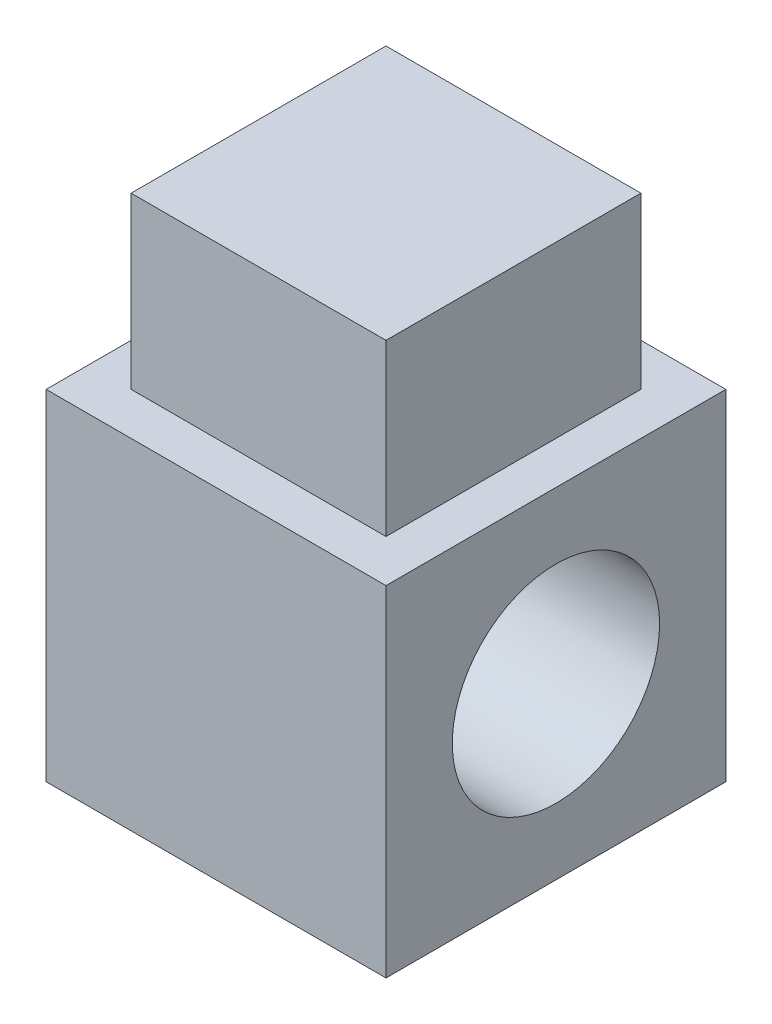
ISO-10303-21;
HEADER;
FILE_DESCRIPTION(('STEP AP214'),'2;1');
FILE_NAME('part.step','',(''),(''),'','','');
FILE_SCHEMA(('AUTOMOTIVE_DESIGN { 1 0 10303 214 1 1 1 1 }'));
ENDSEC;
DATA;
#1=APPLICATION_CONTEXT('core data for automotive mechanical design processes');
#2=APPLICATION_PROTOCOL_DEFINITION('international standard','automotive_design',2000,#1);
#3=PRODUCT_CONTEXT('',#1,'mechanical');
#4=PRODUCT('Part','Part','',(#3));
#5=PRODUCT_RELATED_PRODUCT_CATEGORY('part','',(#4));
#6=PRODUCT_DEFINITION_FORMATION('','',#4);
#7=PRODUCT_DEFINITION_CONTEXT('part definition',#1,'design');
#8=PRODUCT_DEFINITION('design','',#6,#7);
#9=PRODUCT_DEFINITION_SHAPE('','',#8);
#10=(LENGTH_UNIT() NAMED_UNIT(*) SI_UNIT(.MILLI.,.METRE.));
#11=(NAMED_UNIT(*) PLANE_ANGLE_UNIT() SI_UNIT($,.RADIAN.));
#12=(NAMED_UNIT(*) SI_UNIT($,.STERADIAN.) SOLID_ANGLE_UNIT());
#13=UNCERTAINTY_MEASURE_WITH_UNIT(LENGTH_MEASURE(1.E-05),#10,'distance_accuracy_value','');
#14=(GEOMETRIC_REPRESENTATION_CONTEXT(3) GLOBAL_UNCERTAINTY_ASSIGNED_CONTEXT((#13)) GLOBAL_UNIT_ASSIGNED_CONTEXT((#10,
#11,#12)) REPRESENTATION_CONTEXT('',''));
#15=CARTESIAN_POINT('',(0.,0.,0.));
#16=DIRECTION('',(0.,0.,1.));
#17=DIRECTION('',(1.,0.,0.));
#18=AXIS2_PLACEMENT_3D('',#15,#16,#17);
#19=CARTESIAN_POINT('',(10.,10.,10.));
#20=DIRECTION('',(0.,-1.,0.));
#21=DIRECTION('',(0.,0.,-1.));
#22=AXIS2_PLACEMENT_3D('',#19,#20,#21);
#23=PLANE('',#22);
#24=DIRECTION('',(0.,0.,1.));
#25=VECTOR('',#24,1.);
#26=CARTESIAN_POINT('',(-10.,10.,10.));
#27=LINE('',#26,#25);
#28=CARTESIAN_POINT('',(-10.,10.,-10.));
#29=VERTEX_POINT('',#28);
#30=CARTESIAN_POINT('',(-10.,10.,10.));
#31=VERTEX_POINT('',#30);
#32=EDGE_CURVE('E143',#29,#31,#27,.T.);
#33=ORIENTED_EDGE('',*,*,#32,.T.);
#34=DIRECTION('',(-1.,0.,0.));
#35=VECTOR('',#34,1.);
#36=CARTESIAN_POINT('',(10.,10.,10.));
#37=LINE('',#36,#35);
#38=CARTESIAN_POINT('',(10.,10.,10.));
#39=VERTEX_POINT('',#38);
#40=EDGE_CURVE('E40',#39,#31,#37,.T.);
#41=ORIENTED_EDGE('',*,*,#40,.F.);
#42=DIRECTION('',(0.,0.,1.));
#43=VECTOR('',#42,1.);
#44=CARTESIAN_POINT('',(10.,10.,10.));
#45=LINE('',#44,#43);
#46=CARTESIAN_POINT('',(10.,10.,-10.));
#47=VERTEX_POINT('',#46);
#48=EDGE_CURVE('E133',#47,#39,#45,.T.);
#49=ORIENTED_EDGE('',*,*,#48,.F.);
#50=DIRECTION('',(-1.,0.,0.));
#51=VECTOR('',#50,1.);
#52=CARTESIAN_POINT('',(10.,10.,-10.));
#53=LINE('',#52,#51);
#54=EDGE_CURVE('E11',#47,#29,#53,.T.);
#55=ORIENTED_EDGE('',*,*,#54,.T.);
#56=EDGE_LOOP('',(#33,#41,#49,#55));
#57=FACE_BOUND('',#56,.T.);
#58=DIRECTION('',(0.,0.,-1.));
#59=VECTOR('',#58,1.);
#60=CARTESIAN_POINT('',(7.5,10.,-7.5));
#61=LINE('',#60,#59);
#62=CARTESIAN_POINT('',(7.5,10.,7.5));
#63=VERTEX_POINT('',#62);
#64=CARTESIAN_POINT('',(7.5,10.,-7.5));
#65=VERTEX_POINT('',#64);
#66=EDGE_CURVE('E117',#63,#65,#61,.T.);
#67=ORIENTED_EDGE('',*,*,#66,.F.);
#68=DIRECTION('',(1.,0.,0.));
#69=VECTOR('',#68,1.);
#70=CARTESIAN_POINT('',(-7.5,10.,7.5));
#71=LINE('',#70,#69);
#72=CARTESIAN_POINT('',(-7.5,10.,7.5));
#73=VERTEX_POINT('',#72);
#74=EDGE_CURVE('E114',#73,#63,#71,.T.);
#75=ORIENTED_EDGE('',*,*,#74,.F.);
#76=DIRECTION('',(0.,0.,1.));
#77=VECTOR('',#76,1.);
#78=CARTESIAN_POINT('',(-7.5,10.,-7.5));
#79=LINE('',#78,#77);
#80=CARTESIAN_POINT('',(-7.5,10.,-7.5));
#81=VERTEX_POINT('',#80);
#82=EDGE_CURVE('E52',#81,#73,#79,.T.);
#83=ORIENTED_EDGE('',*,*,#82,.F.);
#84=DIRECTION('',(-1.,0.,0.));
#85=VECTOR('',#84,1.);
#86=CARTESIAN_POINT('',(-7.5,10.,-7.5));
#87=LINE('',#86,#85);
#88=EDGE_CURVE('E47',#65,#81,#87,.T.);
#89=ORIENTED_EDGE('',*,*,#88,.F.);
#90=EDGE_LOOP('',(#67,#75,#83,#89));
#91=FACE_BOUND('',#90,.T.);
#92=ADVANCED_FACE('F32',(#57,#91),#23,.F.);
#93=CARTESIAN_POINT('',(10.,0.,0.));
#94=DIRECTION('',(1.,0.,0.));
#95=DIRECTION('',(0.,0.,-1.));
#96=AXIS2_PLACEMENT_3D('',#93,#94,#95);
#97=PLANE('',#96);
#98=DIRECTION('',(0.,1.,0.));
#99=VECTOR('',#98,1.);
#100=CARTESIAN_POINT('',(10.,10.,-10.));
#101=LINE('',#100,#99);
#102=CARTESIAN_POINT('',(10.,-10.,-10.));
#103=VERTEX_POINT('',#102);
#104=EDGE_CURVE('E130',#103,#47,#101,.T.);
#105=ORIENTED_EDGE('',*,*,#104,.T.);
#106=ORIENTED_EDGE('',*,*,#48,.T.);
#107=DIRECTION('',(0.,-1.,0.));
#108=VECTOR('',#107,1.);
#109=CARTESIAN_POINT('',(10.,10.,10.));
#110=LINE('',#109,#108);
#111=CARTESIAN_POINT('',(10.,-10.,10.));
#112=VERTEX_POINT('',#111);
#113=EDGE_CURVE('E136',#39,#112,#110,.T.);
#114=ORIENTED_EDGE('',*,*,#113,.T.);
#115=DIRECTION('',(0.,0.,-1.));
#116=VECTOR('',#115,1.);
#117=CARTESIAN_POINT('',(10.,-10.,10.));
#118=LINE('',#117,#116);
#119=EDGE_CURVE('E138',#112,#103,#118,.T.);
#120=ORIENTED_EDGE('',*,*,#119,.T.);
#121=EDGE_LOOP('',(#105,#106,#114,#120));
#122=FACE_BOUND('',#121,.T.);
#123=CARTESIAN_POINT('',(10.,0.,0.));
#124=DIRECTION('',(1.,0.,0.));
#125=DIRECTION('',(0.,0.,-1.));
#126=AXIS2_PLACEMENT_3D('',#123,#124,#125);
#127=CIRCLE('',#126,6.1);
#128=CARTESIAN_POINT('',(10.,0.,-6.1));
#129=VERTEX_POINT('',#128);
#130=EDGE_CURVE('E121',#129,#129,#127,.T.);
#131=ORIENTED_EDGE('',*,*,#130,.F.);
#132=EDGE_LOOP('',(#131));
#133=FACE_BOUND('',#132,.T.);
#134=ADVANCED_FACE('F173',(#122,#133),#97,.T.);
#135=CARTESIAN_POINT('',(-10.,0.,0.));
#136=DIRECTION('',(1.,0.,0.));
#137=DIRECTION('',(0.,0.,-1.));
#138=AXIS2_PLACEMENT_3D('',#135,#136,#137);
#139=PLANE('',#138);
#140=DIRECTION('',(0.,1.,0.));
#141=VECTOR('',#140,1.);
#142=CARTESIAN_POINT('',(-10.,10.,-10.));
#143=LINE('',#142,#141);
#144=CARTESIAN_POINT('',(-10.,-10.,-10.));
#145=VERTEX_POINT('',#144);
#146=EDGE_CURVE('E128',#145,#29,#143,.T.);
#147=ORIENTED_EDGE('',*,*,#146,.F.);
#148=DIRECTION('',(0.,0.,-1.));
#149=VECTOR('',#148,1.);
#150=CARTESIAN_POINT('',(-10.,-10.,10.));
#151=LINE('',#150,#149);
#152=CARTESIAN_POINT('',(-10.,-10.,10.));
#153=VERTEX_POINT('',#152);
#154=EDGE_CURVE('E134',#153,#145,#151,.T.);
#155=ORIENTED_EDGE('',*,*,#154,.F.);
#156=DIRECTION('',(0.,-1.,0.));
#157=VECTOR('',#156,1.);
#158=CARTESIAN_POINT('',(-10.,10.,10.));
#159=LINE('',#158,#157);
#160=EDGE_CURVE('E145',#31,#153,#159,.T.);
#161=ORIENTED_EDGE('',*,*,#160,.F.);
#162=ORIENTED_EDGE('',*,*,#32,.F.);
#163=EDGE_LOOP('',(#147,#155,#161,#162));
#164=FACE_BOUND('',#163,.T.);
#165=CARTESIAN_POINT('',(-10.,0.,0.));
#166=DIRECTION('',(1.,0.,0.));
#167=DIRECTION('',(0.,0.,-1.));
#168=AXIS2_PLACEMENT_3D('',#165,#166,#167);
#169=CIRCLE('',#168,6.1);
#170=CARTESIAN_POINT('',(-10.,0.,-6.1));
#171=VERTEX_POINT('',#170);
#172=EDGE_CURVE('E118',#171,#171,#169,.T.);
#173=ORIENTED_EDGE('',*,*,#172,.T.);
#174=EDGE_LOOP('',(#173));
#175=FACE_BOUND('',#174,.T.);
#176=ADVANCED_FACE('F163',(#164,#175),#139,.F.);
#177=CARTESIAN_POINT('',(10.,10.,-10.));
#178=DIRECTION('',(0.,0.,1.));
#179=DIRECTION('',(0.,-1.,0.));
#180=AXIS2_PLACEMENT_3D('',#177,#178,#179);
#181=PLANE('',#180);
#182=ORIENTED_EDGE('',*,*,#146,.T.);
#183=ORIENTED_EDGE('',*,*,#54,.F.);
#184=ORIENTED_EDGE('',*,*,#104,.F.);
#185=DIRECTION('',(-1.,0.,0.));
#186=VECTOR('',#185,1.);
#187=CARTESIAN_POINT('',(10.,-10.,-10.));
#188=LINE('',#187,#186);
#189=EDGE_CURVE('E140',#103,#145,#188,.T.);
#190=ORIENTED_EDGE('',*,*,#189,.T.);
#191=EDGE_LOOP('',(#182,#183,#184,#190));
#192=FACE_BOUND('',#191,.T.);
#193=ADVANCED_FACE('F34',(#192),#181,.F.);
#194=CARTESIAN_POINT('',(10.,10.,10.));
#195=DIRECTION('',(0.,0.,-1.));
#196=DIRECTION('',(0.,1.,0.));
#197=AXIS2_PLACEMENT_3D('',#194,#195,#196);
#198=PLANE('',#197);
#199=ORIENTED_EDGE('',*,*,#160,.T.);
#200=DIRECTION('',(-1.,0.,0.));
#201=VECTOR('',#200,1.);
#202=CARTESIAN_POINT('',(10.,-10.,10.));
#203=LINE('',#202,#201);
#204=EDGE_CURVE('E150',#112,#153,#203,.T.);
#205=ORIENTED_EDGE('',*,*,#204,.F.);
#206=ORIENTED_EDGE('',*,*,#113,.F.);
#207=ORIENTED_EDGE('',*,*,#40,.T.);
#208=EDGE_LOOP('',(#199,#205,#206,#207));
#209=FACE_BOUND('',#208,.T.);
#210=ADVANCED_FACE('F157',(#209),#198,.F.);
#211=CARTESIAN_POINT('',(10.,-10.,10.));
#212=DIRECTION('',(0.,1.,0.));
#213=DIRECTION('',(0.,0.,1.));
#214=AXIS2_PLACEMENT_3D('',#211,#212,#213);
#215=PLANE('',#214);
#216=ORIENTED_EDGE('',*,*,#154,.T.);
#217=ORIENTED_EDGE('',*,*,#189,.F.);
#218=ORIENTED_EDGE('',*,*,#119,.F.);
#219=ORIENTED_EDGE('',*,*,#204,.T.);
#220=EDGE_LOOP('',(#216,#217,#218,#219));
#221=FACE_BOUND('',#220,.T.);
#222=ADVANCED_FACE('F167',(#221),#215,.F.);
#223=CARTESIAN_POINT('',(10.,0.,0.));
#224=DIRECTION('',(-1.,0.,0.));
#225=DIRECTION('',(0.,0.,1.));
#226=AXIS2_PLACEMENT_3D('',#223,#224,#225);
#227=CYLINDRICAL_SURFACE('',#226,6.1);
#228=ORIENTED_EDGE('',*,*,#130,.T.);
#229=EDGE_LOOP('',(#228));
#230=FACE_BOUND('',#229,.T.);
#231=ORIENTED_EDGE('',*,*,#172,.F.);
#232=EDGE_LOOP('',(#231));
#233=FACE_BOUND('',#232,.T.);
#234=ADVANCED_FACE('F203',(#230,#233),#227,.F.);
#235=CARTESIAN_POINT('',(7.5,20.,-7.5));
#236=DIRECTION('',(-1.,0.,0.));
#237=DIRECTION('',(0.,0.,1.));
#238=AXIS2_PLACEMENT_3D('',#235,#236,#237);
#239=PLANE('',#238);
#240=ORIENTED_EDGE('',*,*,#66,.T.);
#241=DIRECTION('',(0.,-1.,0.));
#242=VECTOR('',#241,1.);
#243=CARTESIAN_POINT('',(7.5,20.,-7.5));
#244=LINE('',#243,#242);
#245=CARTESIAN_POINT('',(7.5,20.,-7.5));
#246=VERTEX_POINT('',#245);
#247=EDGE_CURVE('E98',#246,#65,#244,.T.);
#248=ORIENTED_EDGE('',*,*,#247,.F.);
#249=DIRECTION('',(0.,0.,-1.));
#250=VECTOR('',#249,1.);
#251=CARTESIAN_POINT('',(7.5,20.,-7.5));
#252=LINE('',#251,#250);
#253=CARTESIAN_POINT('',(7.5,20.,7.5));
#254=VERTEX_POINT('',#253);
#255=EDGE_CURVE('E105',#254,#246,#252,.T.);
#256=ORIENTED_EDGE('',*,*,#255,.F.);
#257=DIRECTION('',(0.,-1.,0.));
#258=VECTOR('',#257,1.);
#259=CARTESIAN_POINT('',(7.5,20.,7.5));
#260=LINE('',#259,#258);
#261=EDGE_CURVE('E181',#254,#63,#260,.T.);
#262=ORIENTED_EDGE('',*,*,#261,.T.);
#263=EDGE_LOOP('',(#240,#248,#256,#262));
#264=FACE_BOUND('',#263,.T.);
#265=ADVANCED_FACE('F116',(#264),#239,.F.);
#266=CARTESIAN_POINT('',(-7.5,20.,-7.5));
#267=DIRECTION('',(0.,0.,1.));
#268=DIRECTION('',(1.,0.,0.));
#269=AXIS2_PLACEMENT_3D('',#266,#267,#268);
#270=PLANE('',#269);
#271=ORIENTED_EDGE('',*,*,#88,.T.);
#272=DIRECTION('',(0.,-1.,0.));
#273=VECTOR('',#272,1.);
#274=CARTESIAN_POINT('',(-7.5,20.,-7.5));
#275=LINE('',#274,#273);
#276=CARTESIAN_POINT('',(-7.5,20.,-7.5));
#277=VERTEX_POINT('',#276);
#278=EDGE_CURVE('E101',#277,#81,#275,.T.);
#279=ORIENTED_EDGE('',*,*,#278,.F.);
#280=DIRECTION('',(-1.,0.,0.));
#281=VECTOR('',#280,1.);
#282=CARTESIAN_POINT('',(-7.5,20.,-7.5));
#283=LINE('',#282,#281);
#284=EDGE_CURVE('E94',#246,#277,#283,.T.);
#285=ORIENTED_EDGE('',*,*,#284,.F.);
#286=ORIENTED_EDGE('',*,*,#247,.T.);
#287=EDGE_LOOP('',(#271,#279,#285,#286));
#288=FACE_BOUND('',#287,.T.);
#289=ADVANCED_FACE('F96',(#288),#270,.F.);
#290=CARTESIAN_POINT('',(-7.5,20.,-7.5));
#291=DIRECTION('',(1.,0.,0.));
#292=DIRECTION('',(0.,0.,-1.));
#293=AXIS2_PLACEMENT_3D('',#290,#291,#292);
#294=PLANE('',#293);
#295=ORIENTED_EDGE('',*,*,#82,.T.);
#296=DIRECTION('',(0.,-1.,0.));
#297=VECTOR('',#296,1.);
#298=CARTESIAN_POINT('',(-7.5,20.,7.5));
#299=LINE('',#298,#297);
#300=CARTESIAN_POINT('',(-7.5,20.,7.5));
#301=VERTEX_POINT('',#300);
#302=EDGE_CURVE('E123',#301,#73,#299,.T.);
#303=ORIENTED_EDGE('',*,*,#302,.F.);
#304=DIRECTION('',(0.,0.,1.));
#305=VECTOR('',#304,1.);
#306=CARTESIAN_POINT('',(-7.5,20.,-7.5));
#307=LINE('',#306,#305);
#308=EDGE_CURVE('E104',#277,#301,#307,.T.);
#309=ORIENTED_EDGE('',*,*,#308,.F.);
#310=ORIENTED_EDGE('',*,*,#278,.T.);
#311=EDGE_LOOP('',(#295,#303,#309,#310));
#312=FACE_BOUND('',#311,.T.);
#313=ADVANCED_FACE('F190',(#312),#294,.F.);
#314=CARTESIAN_POINT('',(-7.5,20.,7.5));
#315=DIRECTION('',(0.,0.,-1.));
#316=DIRECTION('',(-1.,0.,0.));
#317=AXIS2_PLACEMENT_3D('',#314,#315,#316);
#318=PLANE('',#317);
#319=ORIENTED_EDGE('',*,*,#74,.T.);
#320=ORIENTED_EDGE('',*,*,#261,.F.);
#321=DIRECTION('',(1.,0.,0.));
#322=VECTOR('',#321,1.);
#323=CARTESIAN_POINT('',(-7.5,20.,7.5));
#324=LINE('',#323,#322);
#325=EDGE_CURVE('E110',#301,#254,#324,.T.);
#326=ORIENTED_EDGE('',*,*,#325,.F.);
#327=ORIENTED_EDGE('',*,*,#302,.T.);
#328=EDGE_LOOP('',(#319,#320,#326,#327));
#329=FACE_BOUND('',#328,.T.);
#330=ADVANCED_FACE('F180',(#329),#318,.F.);
#331=CARTESIAN_POINT('',(0.,20.,0.));
#332=DIRECTION('',(0.,1.,0.));
#333=DIRECTION('',(0.,0.,1.));
#334=AXIS2_PLACEMENT_3D('',#331,#332,#333);
#335=PLANE('',#334);
#336=ORIENTED_EDGE('',*,*,#255,.T.);
#337=ORIENTED_EDGE('',*,*,#284,.T.);
#338=ORIENTED_EDGE('',*,*,#308,.T.);
#339=ORIENTED_EDGE('',*,*,#325,.T.);
#340=EDGE_LOOP('',(#336,#337,#338,#339));
#341=FACE_BOUND('',#340,.T.);
#342=ADVANCED_FACE('F108',(#341),#335,.T.);
#343=CLOSED_SHELL('',(#92,#134,#176,#193,#210,#222,#234,#265,#289,#313,#330,#342));
#344=MANIFOLD_SOLID_BREP('B2',#343);
#345=ADVANCED_BREP_SHAPE_REPRESENTATION('',(#18,#344),#14);
#346=SHAPE_DEFINITION_REPRESENTATION(#9,#345);
ENDSEC;
END-ISO-10303-21;
